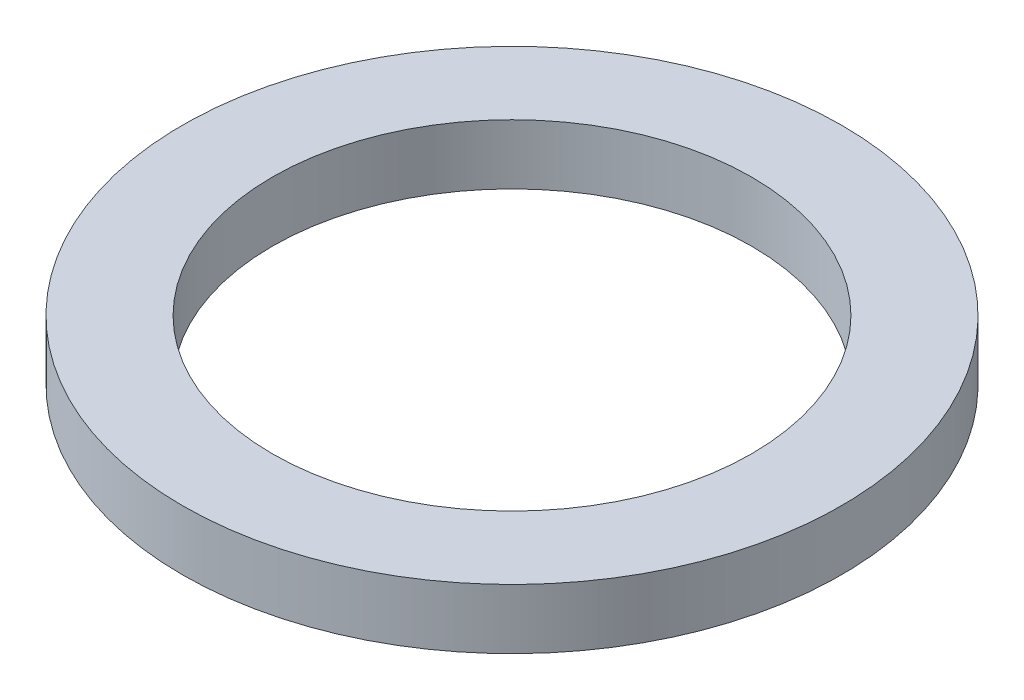
ISO-10303-21;
HEADER;
FILE_DESCRIPTION(('STEP AP214'),'2;1');
FILE_NAME('part.step','',(''),(''),'','','');
FILE_SCHEMA(('AUTOMOTIVE_DESIGN { 1 0 10303 214 1 1 1 1 }'));
ENDSEC;
DATA;
#1=APPLICATION_CONTEXT('core data for automotive mechanical design processes');
#2=APPLICATION_PROTOCOL_DEFINITION('international standard','automotive_design',2000,#1);
#3=PRODUCT_CONTEXT('',#1,'mechanical');
#4=PRODUCT('Part','Part','',(#3));
#5=PRODUCT_RELATED_PRODUCT_CATEGORY('part','',(#4));
#6=PRODUCT_DEFINITION_FORMATION('','',#4);
#7=PRODUCT_DEFINITION_CONTEXT('part definition',#1,'design');
#8=PRODUCT_DEFINITION('design','',#6,#7);
#9=PRODUCT_DEFINITION_SHAPE('','',#8);
#10=(LENGTH_UNIT() NAMED_UNIT(*) SI_UNIT(.MILLI.,.METRE.));
#11=(NAMED_UNIT(*) PLANE_ANGLE_UNIT() SI_UNIT($,.RADIAN.));
#12=(NAMED_UNIT(*) SI_UNIT($,.STERADIAN.) SOLID_ANGLE_UNIT());
#13=UNCERTAINTY_MEASURE_WITH_UNIT(LENGTH_MEASURE(1.E-05),#10,'distance_accuracy_value','');
#14=(GEOMETRIC_REPRESENTATION_CONTEXT(3) GLOBAL_UNCERTAINTY_ASSIGNED_CONTEXT((#13)) GLOBAL_UNIT_ASSIGNED_CONTEXT((#10,
#11,#12)) REPRESENTATION_CONTEXT('',''));
#15=CARTESIAN_POINT('',(0.,0.,0.));
#16=DIRECTION('',(0.,0.,1.));
#17=DIRECTION('',(1.,0.,0.));
#18=AXIS2_PLACEMENT_3D('',#15,#16,#17);
#19=CARTESIAN_POINT('',(0.,5.,0.));
#20=DIRECTION('',(0.,-1.,0.));
#21=DIRECTION('',(0.,0.,-1.));
#22=AXIS2_PLACEMENT_3D('',#19,#20,#21);
#23=CYLINDRICAL_SURFACE('',#22,27.5);
#24=CARTESIAN_POINT('',(0.,5.,0.));
#25=DIRECTION('',(0.,1.,0.));
#26=DIRECTION('',(0.,0.,1.));
#27=AXIS2_PLACEMENT_3D('',#24,#25,#26);
#28=CIRCLE('',#27,27.5);
#29=CARTESIAN_POINT('',(0.,5.,27.5));
#30=VERTEX_POINT('',#29);
#31=EDGE_CURVE('E10',#30,#30,#28,.T.);
#32=ORIENTED_EDGE('',*,*,#31,.F.);
#33=EDGE_LOOP('',(#32));
#34=FACE_BOUND('',#33,.T.);
#35=CARTESIAN_POINT('',(0.,0.,0.));
#36=DIRECTION('',(0.,1.,0.));
#37=DIRECTION('',(0.,0.,1.));
#38=AXIS2_PLACEMENT_3D('',#35,#36,#37);
#39=CIRCLE('',#38,27.5);
#40=CARTESIAN_POINT('',(0.,0.,27.5));
#41=VERTEX_POINT('',#40);
#42=EDGE_CURVE('E37',#41,#41,#39,.T.);
#43=ORIENTED_EDGE('',*,*,#42,.T.);
#44=EDGE_LOOP('',(#43));
#45=FACE_BOUND('',#44,.T.);
#46=ADVANCED_FACE('F40',(#34,#45),#23,.T.);
#47=CARTESIAN_POINT('',(0.,5.,0.));
#48=DIRECTION('',(0.,1.,0.));
#49=DIRECTION('',(0.,0.,1.));
#50=AXIS2_PLACEMENT_3D('',#47,#48,#49);
#51=PLANE('',#50);
#52=CARTESIAN_POINT('',(0.,5.,0.));
#53=DIRECTION('',(0.,1.,0.));
#54=DIRECTION('',(0.,0.,1.));
#55=AXIS2_PLACEMENT_3D('',#52,#53,#54);
#56=CIRCLE('',#55,20.);
#57=CARTESIAN_POINT('',(0.,5.,20.));
#58=VERTEX_POINT('',#57);
#59=EDGE_CURVE('E50',#58,#58,#56,.T.);
#60=ORIENTED_EDGE('',*,*,#59,.F.);
#61=EDGE_LOOP('',(#60));
#62=FACE_BOUND('',#61,.T.);
#63=ORIENTED_EDGE('',*,*,#31,.T.);
#64=EDGE_LOOP('',(#63));
#65=FACE_BOUND('',#64,.T.);
#66=ADVANCED_FACE('F59',(#62,#65),#51,.T.);
#67=CARTESIAN_POINT('',(0.,0.,0.));
#68=DIRECTION('',(0.,1.,0.));
#69=DIRECTION('',(0.,0.,1.));
#70=AXIS2_PLACEMENT_3D('',#67,#68,#69);
#71=PLANE('',#70);
#72=CARTESIAN_POINT('',(0.,0.,0.));
#73=DIRECTION('',(0.,1.,0.));
#74=DIRECTION('',(0.,0.,1.));
#75=AXIS2_PLACEMENT_3D('',#72,#73,#74);
#76=CIRCLE('',#75,20.);
#77=CARTESIAN_POINT('',(0.,0.,20.));
#78=VERTEX_POINT('',#77);
#79=EDGE_CURVE('E47',#78,#78,#76,.T.);
#80=ORIENTED_EDGE('',*,*,#79,.T.);
#81=EDGE_LOOP('',(#80));
#82=FACE_BOUND('',#81,.T.);
#83=ORIENTED_EDGE('',*,*,#42,.F.);
#84=EDGE_LOOP('',(#83));
#85=FACE_BOUND('',#84,.T.);
#86=ADVANCED_FACE('F58',(#82,#85),#71,.F.);
#87=CARTESIAN_POINT('',(0.,5.,0.));
#88=DIRECTION('',(0.,-1.,0.));
#89=DIRECTION('',(0.,0.,-1.));
#90=AXIS2_PLACEMENT_3D('',#87,#88,#89);
#91=CYLINDRICAL_SURFACE('',#90,20.);
#92=ORIENTED_EDGE('',*,*,#59,.T.);
#93=EDGE_LOOP('',(#92));
#94=FACE_BOUND('',#93,.T.);
#95=ORIENTED_EDGE('',*,*,#79,.F.);
#96=EDGE_LOOP('',(#95));
#97=FACE_BOUND('',#96,.T.);
#98=ADVANCED_FACE('F54',(#94,#97),#91,.F.);
#99=CLOSED_SHELL('',(#46,#66,#86,#98));
#100=MANIFOLD_SOLID_BREP('B2',#99);
#101=ADVANCED_BREP_SHAPE_REPRESENTATION('',(#18,#100),#14);
#102=SHAPE_DEFINITION_REPRESENTATION(#9,#101);
ENDSEC;
END-ISO-10303-21;
